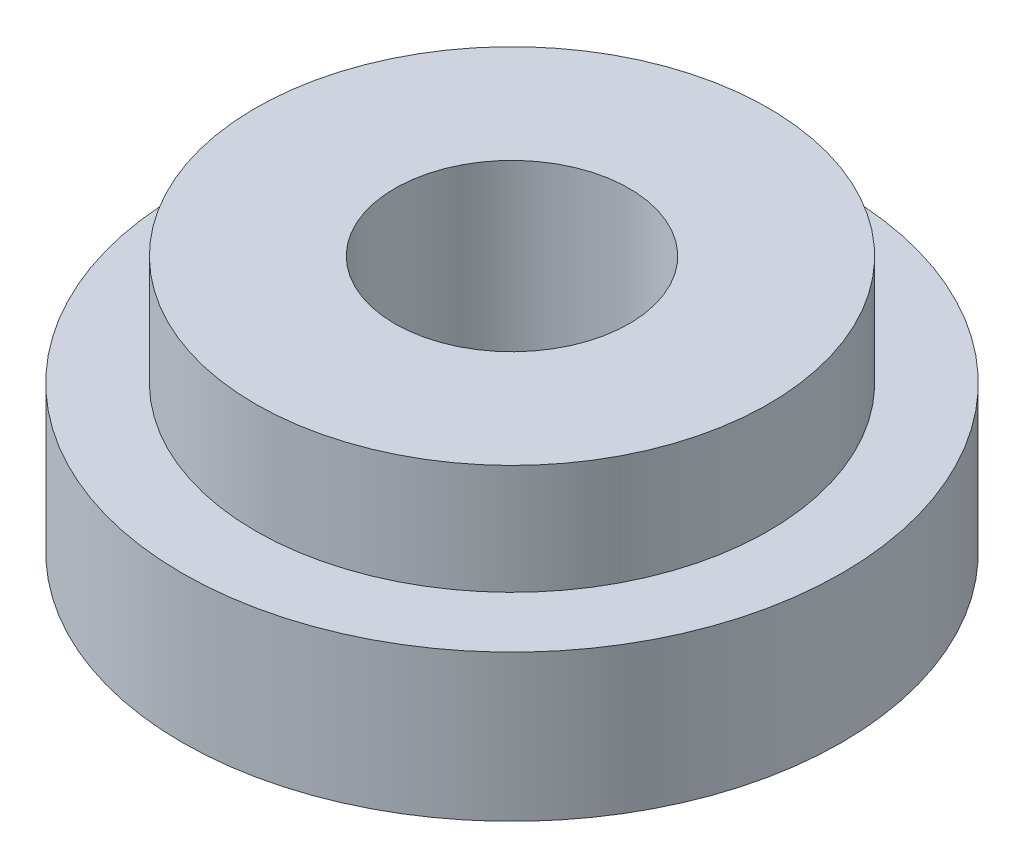
ISO-10303-21;
HEADER;
FILE_DESCRIPTION(('STEP AP214'),'2;1');
FILE_NAME('part.step','',(''),(''),'','','');
FILE_SCHEMA(('AUTOMOTIVE_DESIGN { 1 0 10303 214 1 1 1 1 }'));
ENDSEC;
DATA;
#1=APPLICATION_CONTEXT('core data for automotive mechanical design processes');
#2=APPLICATION_PROTOCOL_DEFINITION('international standard','automotive_design',2000,#1);
#3=PRODUCT_CONTEXT('',#1,'mechanical');
#4=PRODUCT('Part','Part','',(#3));
#5=PRODUCT_RELATED_PRODUCT_CATEGORY('part','',(#4));
#6=PRODUCT_DEFINITION_FORMATION('','',#4);
#7=PRODUCT_DEFINITION_CONTEXT('part definition',#1,'design');
#8=PRODUCT_DEFINITION('design','',#6,#7);
#9=PRODUCT_DEFINITION_SHAPE('','',#8);
#10=(LENGTH_UNIT() NAMED_UNIT(*) SI_UNIT(.MILLI.,.METRE.));
#11=(NAMED_UNIT(*) PLANE_ANGLE_UNIT() SI_UNIT($,.RADIAN.));
#12=(NAMED_UNIT(*) SI_UNIT($,.STERADIAN.) SOLID_ANGLE_UNIT());
#13=UNCERTAINTY_MEASURE_WITH_UNIT(LENGTH_MEASURE(1.E-05),#10,'distance_accuracy_value','');
#14=(GEOMETRIC_REPRESENTATION_CONTEXT(3) GLOBAL_UNCERTAINTY_ASSIGNED_CONTEXT((#13)) GLOBAL_UNIT_ASSIGNED_CONTEXT((#10,
#11,#12)) REPRESENTATION_CONTEXT('',''));
#15=CARTESIAN_POINT('',(0.,0.,0.));
#16=DIRECTION('',(0.,0.,1.));
#17=DIRECTION('',(1.,0.,0.));
#18=AXIS2_PLACEMENT_3D('',#15,#16,#17);
#19=CARTESIAN_POINT('',(0.,2.,0.));
#20=DIRECTION('',(0.,-1.,0.));
#21=DIRECTION('',(0.,0.,-1.));
#22=AXIS2_PLACEMENT_3D('',#19,#20,#21);
#23=CYLINDRICAL_SURFACE('',#22,4.5);
#24=CARTESIAN_POINT('',(0.,2.,0.));
#25=DIRECTION('',(0.,1.,0.));
#26=DIRECTION('',(0.,0.,1.));
#27=AXIS2_PLACEMENT_3D('',#24,#25,#26);
#28=CIRCLE('',#27,4.5);
#29=CARTESIAN_POINT('',(0.,2.,4.5));
#30=VERTEX_POINT('',#29);
#31=EDGE_CURVE('E38',#30,#30,#28,.T.);
#32=ORIENTED_EDGE('',*,*,#31,.F.);
#33=EDGE_LOOP('',(#32));
#34=FACE_BOUND('',#33,.T.);
#35=CARTESIAN_POINT('',(0.,0.,0.));
#36=DIRECTION('',(0.,1.,0.));
#37=DIRECTION('',(0.,0.,1.));
#38=AXIS2_PLACEMENT_3D('',#35,#36,#37);
#39=CIRCLE('',#38,4.5);
#40=CARTESIAN_POINT('',(0.,0.,4.5));
#41=VERTEX_POINT('',#40);
#42=EDGE_CURVE('E34',#41,#41,#39,.T.);
#43=ORIENTED_EDGE('',*,*,#42,.T.);
#44=EDGE_LOOP('',(#43));
#45=FACE_BOUND('',#44,.T.);
#46=ADVANCED_FACE('F31',(#34,#45),#23,.T.);
#47=CARTESIAN_POINT('',(0.,2.,0.));
#48=DIRECTION('',(0.,1.,0.));
#49=DIRECTION('',(0.,0.,1.));
#50=AXIS2_PLACEMENT_3D('',#47,#48,#49);
#51=PLANE('',#50);
#52=CARTESIAN_POINT('',(0.,2.,0.));
#53=DIRECTION('',(0.,1.,0.));
#54=DIRECTION('',(0.,0.,1.));
#55=AXIS2_PLACEMENT_3D('',#52,#53,#54);
#56=CIRCLE('',#55,3.5);
#57=CARTESIAN_POINT('',(0.,2.,3.5));
#58=VERTEX_POINT('',#57);
#59=EDGE_CURVE('E10',#58,#58,#56,.T.);
#60=ORIENTED_EDGE('',*,*,#59,.F.);
#61=EDGE_LOOP('',(#60));
#62=FACE_BOUND('',#61,.T.);
#63=ORIENTED_EDGE('',*,*,#31,.T.);
#64=EDGE_LOOP('',(#63));
#65=FACE_BOUND('',#64,.T.);
#66=ADVANCED_FACE('F75',(#62,#65),#51,.T.);
#67=CARTESIAN_POINT('',(0.,0.,0.));
#68=DIRECTION('',(0.,1.,0.));
#69=DIRECTION('',(0.,0.,1.));
#70=AXIS2_PLACEMENT_3D('',#67,#68,#69);
#71=PLANE('',#70);
#72=CARTESIAN_POINT('',(0.,0.,0.));
#73=DIRECTION('',(0.,1.,0.));
#74=DIRECTION('',(0.,0.,1.));
#75=AXIS2_PLACEMENT_3D('',#72,#73,#74);
#76=CIRCLE('',#75,1.6);
#77=CARTESIAN_POINT('',(0.,0.,1.6));
#78=VERTEX_POINT('',#77);
#79=EDGE_CURVE('E47',#78,#78,#76,.T.);
#80=ORIENTED_EDGE('',*,*,#79,.T.);
#81=EDGE_LOOP('',(#80));
#82=FACE_BOUND('',#81,.T.);
#83=ORIENTED_EDGE('',*,*,#42,.F.);
#84=EDGE_LOOP('',(#83));
#85=FACE_BOUND('',#84,.T.);
#86=ADVANCED_FACE('F54',(#82,#85),#71,.F.);
#87=CARTESIAN_POINT('',(0.,3.5,0.));
#88=DIRECTION('',(0.,-1.,0.));
#89=DIRECTION('',(0.,0.,-1.));
#90=AXIS2_PLACEMENT_3D('',#87,#88,#89);
#91=CYLINDRICAL_SURFACE('',#90,3.5);
#92=CARTESIAN_POINT('',(0.,3.5,0.));
#93=DIRECTION('',(0.,1.,0.));
#94=DIRECTION('',(0.,0.,1.));
#95=AXIS2_PLACEMENT_3D('',#92,#93,#94);
#96=CIRCLE('',#95,3.5);
#97=CARTESIAN_POINT('',(0.,3.5,3.5));
#98=VERTEX_POINT('',#97);
#99=EDGE_CURVE('E44',#98,#98,#96,.T.);
#100=ORIENTED_EDGE('',*,*,#99,.F.);
#101=EDGE_LOOP('',(#100));
#102=FACE_BOUND('',#101,.T.);
#103=ORIENTED_EDGE('',*,*,#59,.T.);
#104=EDGE_LOOP('',(#103));
#105=FACE_BOUND('',#104,.T.);
#106=ADVANCED_FACE('F66',(#102,#105),#91,.T.);
#107=CARTESIAN_POINT('',(0.,3.5,0.));
#108=DIRECTION('',(0.,1.,0.));
#109=DIRECTION('',(0.,0.,1.));
#110=AXIS2_PLACEMENT_3D('',#107,#108,#109);
#111=PLANE('',#110);
#112=CARTESIAN_POINT('',(0.,3.5,0.));
#113=DIRECTION('',(0.,1.,0.));
#114=DIRECTION('',(0.,0.,1.));
#115=AXIS2_PLACEMENT_3D('',#112,#113,#114);
#116=CIRCLE('',#115,1.6);
#117=CARTESIAN_POINT('',(0.,3.5,1.6));
#118=VERTEX_POINT('',#117);
#119=EDGE_CURVE('E48',#118,#118,#116,.T.);
#120=ORIENTED_EDGE('',*,*,#119,.F.);
#121=EDGE_LOOP('',(#120));
#122=FACE_BOUND('',#121,.T.);
#123=ORIENTED_EDGE('',*,*,#99,.T.);
#124=EDGE_LOOP('',(#123));
#125=FACE_BOUND('',#124,.T.);
#126=ADVANCED_FACE('F60',(#122,#125),#111,.T.);
#127=CARTESIAN_POINT('',(0.,0.,0.));
#128=DIRECTION('',(0.,1.,0.));
#129=DIRECTION('',(0.,0.,1.));
#130=AXIS2_PLACEMENT_3D('',#127,#128,#129);
#131=CYLINDRICAL_SURFACE('',#130,1.6);
#132=ORIENTED_EDGE('',*,*,#79,.F.);
#133=EDGE_LOOP('',(#132));
#134=FACE_BOUND('',#133,.T.);
#135=ORIENTED_EDGE('',*,*,#119,.T.);
#136=EDGE_LOOP('',(#135));
#137=FACE_BOUND('',#136,.T.);
#138=ADVANCED_FACE('F57',(#134,#137),#131,.F.);
#139=CLOSED_SHELL('',(#46,#66,#86,#106,#126,#138));
#140=MANIFOLD_SOLID_BREP('B2',#139);
#141=ADVANCED_BREP_SHAPE_REPRESENTATION('',(#18,#140),#14);
#142=SHAPE_DEFINITION_REPRESENTATION(#9,#141);
ENDSEC;
END-ISO-10303-21;
